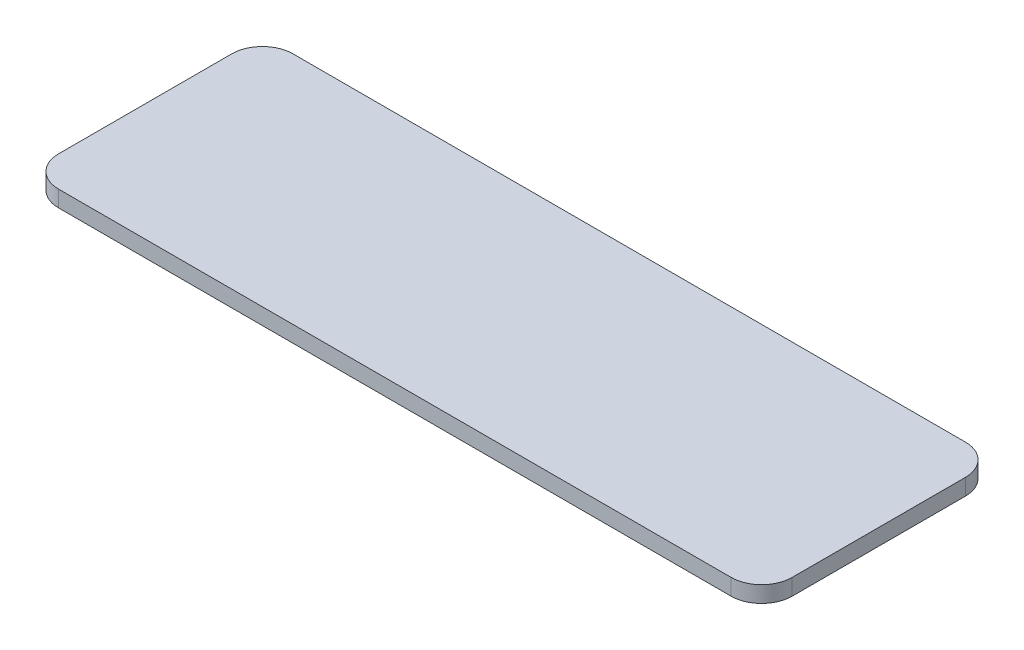
ISO-10303-21;
HEADER;
FILE_DESCRIPTION(('STEP AP214'),'2;1');
FILE_NAME('part.step','',(''),(''),'','','');
FILE_SCHEMA(('AUTOMOTIVE_DESIGN { 1 0 10303 214 1 1 1 1 }'));
ENDSEC;
DATA;
#1=APPLICATION_CONTEXT('core data for automotive mechanical design processes');
#2=APPLICATION_PROTOCOL_DEFINITION('international standard','automotive_design',2000,#1);
#3=PRODUCT_CONTEXT('',#1,'mechanical');
#4=PRODUCT('Part','Part','',(#3));
#5=PRODUCT_RELATED_PRODUCT_CATEGORY('part','',(#4));
#6=PRODUCT_DEFINITION_FORMATION('','',#4);
#7=PRODUCT_DEFINITION_CONTEXT('part definition',#1,'design');
#8=PRODUCT_DEFINITION('design','',#6,#7);
#9=PRODUCT_DEFINITION_SHAPE('','',#8);
#10=(LENGTH_UNIT() NAMED_UNIT(*) SI_UNIT(.MILLI.,.METRE.));
#11=(NAMED_UNIT(*) PLANE_ANGLE_UNIT() SI_UNIT($,.RADIAN.));
#12=(NAMED_UNIT(*) SI_UNIT($,.STERADIAN.) SOLID_ANGLE_UNIT());
#13=UNCERTAINTY_MEASURE_WITH_UNIT(LENGTH_MEASURE(1.E-05),#10,'distance_accuracy_value','');
#14=(GEOMETRIC_REPRESENTATION_CONTEXT(3) GLOBAL_UNCERTAINTY_ASSIGNED_CONTEXT((#13)) GLOBAL_UNIT_ASSIGNED_CONTEXT((#10,
#11,#12)) REPRESENTATION_CONTEXT('',''));
#15=CARTESIAN_POINT('',(0.,0.,0.));
#16=DIRECTION('',(0.,0.,1.));
#17=DIRECTION('',(1.,0.,0.));
#18=AXIS2_PLACEMENT_3D('',#15,#16,#17);
#19=CARTESIAN_POINT('',(3.,1.6,-3.));
#20=DIRECTION('',(0.,-1.,0.));
#21=DIRECTION('',(0.,0.,-1.));
#22=AXIS2_PLACEMENT_3D('',#19,#20,#21);
#23=CYLINDRICAL_SURFACE('',#22,3.);
#24=CARTESIAN_POINT('',(3.,0.,-3.));
#25=DIRECTION('',(0.,1.,0.));
#26=DIRECTION('',(0.,0.,-1.));
#27=AXIS2_PLACEMENT_3D('',#24,#25,#26);
#28=CIRCLE('',#27,3.);
#29=CARTESIAN_POINT('',(0.,0.,-3.00000000000002));
#30=VERTEX_POINT('',#29);
#31=CARTESIAN_POINT('',(3.00000000000002,0.,0.));
#32=VERTEX_POINT('',#31);
#33=EDGE_CURVE('E128',#30,#32,#28,.T.);
#34=ORIENTED_EDGE('',*,*,#33,.T.);
#35=DIRECTION('',(0.,-1.,0.));
#36=VECTOR('',#35,1.);
#37=CARTESIAN_POINT('',(3.00000000000002,1.6,0.));
#38=LINE('',#37,#36);
#39=CARTESIAN_POINT('',(3.00000000000002,1.6,0.));
#40=VERTEX_POINT('',#39);
#41=EDGE_CURVE('E11',#40,#32,#38,.T.);
#42=ORIENTED_EDGE('',*,*,#41,.F.);
#43=CARTESIAN_POINT('',(3.,1.6,-3.));
#44=DIRECTION('',(0.,1.,0.));
#45=DIRECTION('',(0.,0.,-1.));
#46=AXIS2_PLACEMENT_3D('',#43,#44,#45);
#47=CIRCLE('',#46,3.);
#48=CARTESIAN_POINT('',(0.,1.6,-3.00000000000002));
#49=VERTEX_POINT('',#48);
#50=EDGE_CURVE('E142',#49,#40,#47,.T.);
#51=ORIENTED_EDGE('',*,*,#50,.F.);
#52=DIRECTION('',(0.,-1.,0.));
#53=VECTOR('',#52,1.);
#54=CARTESIAN_POINT('',(0.,1.6,-3.00000000000002));
#55=LINE('',#54,#53);
#56=EDGE_CURVE('E124',#49,#30,#55,.T.);
#57=ORIENTED_EDGE('',*,*,#56,.T.);
#58=EDGE_LOOP('',(#34,#42,#51,#57));
#59=FACE_BOUND('',#58,.T.);
#60=ADVANCED_FACE('F32',(#59),#23,.T.);
#61=CARTESIAN_POINT('',(3.00000000000002,1.6,0.));
#62=DIRECTION('',(0.,0.,-1.));
#63=DIRECTION('',(-1.,0.,0.));
#64=AXIS2_PLACEMENT_3D('',#61,#62,#63);
#65=PLANE('',#64);
#66=DIRECTION('',(1.,0.,0.));
#67=VECTOR('',#66,1.);
#68=CARTESIAN_POINT('',(3.00000000000002,0.,0.));
#69=LINE('',#68,#67);
#70=CARTESIAN_POINT('',(69.,0.,0.));
#71=VERTEX_POINT('',#70);
#72=EDGE_CURVE('E131',#32,#71,#69,.T.);
#73=ORIENTED_EDGE('',*,*,#72,.T.);
#74=DIRECTION('',(0.,-1.,0.));
#75=VECTOR('',#74,1.);
#76=CARTESIAN_POINT('',(69.,1.6,0.));
#77=LINE('',#76,#75);
#78=CARTESIAN_POINT('',(69.,1.6,0.));
#79=VERTEX_POINT('',#78);
#80=EDGE_CURVE('E40',#79,#71,#77,.T.);
#81=ORIENTED_EDGE('',*,*,#80,.F.);
#82=DIRECTION('',(1.,0.,0.));
#83=VECTOR('',#82,1.);
#84=CARTESIAN_POINT('',(3.00000000000002,1.6,0.));
#85=LINE('',#84,#83);
#86=EDGE_CURVE('E91',#40,#79,#85,.T.);
#87=ORIENTED_EDGE('',*,*,#86,.F.);
#88=ORIENTED_EDGE('',*,*,#41,.T.);
#89=EDGE_LOOP('',(#73,#81,#87,#88));
#90=FACE_BOUND('',#89,.T.);
#91=ADVANCED_FACE('F177',(#90),#65,.F.);
#92=CARTESIAN_POINT('',(69.,1.6,-3.));
#93=DIRECTION('',(0.,-1.,0.));
#94=DIRECTION('',(0.,0.,-1.));
#95=AXIS2_PLACEMENT_3D('',#92,#93,#94);
#96=CYLINDRICAL_SURFACE('',#95,3.);
#97=CARTESIAN_POINT('',(69.,0.,-3.));
#98=DIRECTION('',(0.,1.,0.));
#99=DIRECTION('',(0.,0.,1.));
#100=AXIS2_PLACEMENT_3D('',#97,#98,#99);
#101=CIRCLE('',#100,3.);
#102=CARTESIAN_POINT('',(72.,0.,-3.00000000000002));
#103=VERTEX_POINT('',#102);
#104=EDGE_CURVE('E133',#71,#103,#101,.T.);
#105=ORIENTED_EDGE('',*,*,#104,.T.);
#106=DIRECTION('',(0.,-1.,0.));
#107=VECTOR('',#106,1.);
#108=CARTESIAN_POINT('',(72.,1.6,-3.00000000000002));
#109=LINE('',#108,#107);
#110=CARTESIAN_POINT('',(72.,1.6,-3.00000000000002));
#111=VERTEX_POINT('',#110);
#112=EDGE_CURVE('E149',#111,#103,#109,.T.);
#113=ORIENTED_EDGE('',*,*,#112,.F.);
#114=CARTESIAN_POINT('',(69.,1.6,-3.));
#115=DIRECTION('',(0.,1.,0.));
#116=DIRECTION('',(0.,0.,1.));
#117=AXIS2_PLACEMENT_3D('',#114,#115,#116);
#118=CIRCLE('',#117,3.);
#119=EDGE_CURVE('E157',#79,#111,#118,.T.);
#120=ORIENTED_EDGE('',*,*,#119,.F.);
#121=ORIENTED_EDGE('',*,*,#80,.T.);
#122=EDGE_LOOP('',(#105,#113,#120,#121));
#123=FACE_BOUND('',#122,.T.);
#124=ADVANCED_FACE('F155',(#123),#96,.T.);
#125=CARTESIAN_POINT('',(72.,1.6,-3.00000000000002));
#126=DIRECTION('',(-1.,0.,0.));
#127=DIRECTION('',(0.,0.,1.));
#128=AXIS2_PLACEMENT_3D('',#125,#126,#127);
#129=PLANE('',#128);
#130=DIRECTION('',(0.,0.,-1.));
#131=VECTOR('',#130,1.);
#132=CARTESIAN_POINT('',(72.,0.,-3.00000000000002));
#133=LINE('',#132,#131);
#134=CARTESIAN_POINT('',(72.,0.,-20.));
#135=VERTEX_POINT('',#134);
#136=EDGE_CURVE('E135',#103,#135,#133,.T.);
#137=ORIENTED_EDGE('',*,*,#136,.T.);
#138=DIRECTION('',(0.,-1.,0.));
#139=VECTOR('',#138,1.);
#140=CARTESIAN_POINT('',(72.,1.6,-20.));
#141=LINE('',#140,#139);
#142=CARTESIAN_POINT('',(72.,1.6,-20.));
#143=VERTEX_POINT('',#142);
#144=EDGE_CURVE('E146',#143,#135,#141,.T.);
#145=ORIENTED_EDGE('',*,*,#144,.F.);
#146=DIRECTION('',(0.,0.,-1.));
#147=VECTOR('',#146,1.);
#148=CARTESIAN_POINT('',(72.,1.6,-3.00000000000002));
#149=LINE('',#148,#147);
#150=EDGE_CURVE('E169',#111,#143,#149,.T.);
#151=ORIENTED_EDGE('',*,*,#150,.F.);
#152=ORIENTED_EDGE('',*,*,#112,.T.);
#153=EDGE_LOOP('',(#137,#145,#151,#152));
#154=FACE_BOUND('',#153,.T.);
#155=ADVANCED_FACE('F165',(#154),#129,.F.);
#156=CARTESIAN_POINT('',(69.,1.6,-20.));
#157=DIRECTION('',(0.,-1.,0.));
#158=DIRECTION('',(0.,0.,-1.));
#159=AXIS2_PLACEMENT_3D('',#156,#157,#158);
#160=CYLINDRICAL_SURFACE('',#159,3.);
#161=CARTESIAN_POINT('',(69.,0.,-20.));
#162=DIRECTION('',(0.,1.,0.));
#163=DIRECTION('',(0.,0.,-1.));
#164=AXIS2_PLACEMENT_3D('',#161,#162,#163);
#165=CIRCLE('',#164,3.);
#166=CARTESIAN_POINT('',(69.,0.,-23.));
#167=VERTEX_POINT('',#166);
#168=EDGE_CURVE('E137',#135,#167,#165,.T.);
#169=ORIENTED_EDGE('',*,*,#168,.T.);
#170=DIRECTION('',(0.,-1.,0.));
#171=VECTOR('',#170,1.);
#172=CARTESIAN_POINT('',(69.,1.6,-23.));
#173=LINE('',#172,#171);
#174=CARTESIAN_POINT('',(69.,1.6,-23.));
#175=VERTEX_POINT('',#174);
#176=EDGE_CURVE('E119',#175,#167,#173,.T.);
#177=ORIENTED_EDGE('',*,*,#176,.F.);
#178=CARTESIAN_POINT('',(69.,1.6,-20.));
#179=DIRECTION('',(0.,1.,0.));
#180=DIRECTION('',(0.,0.,-1.));
#181=AXIS2_PLACEMENT_3D('',#178,#179,#180);
#182=CIRCLE('',#181,3.);
#183=EDGE_CURVE('E110',#143,#175,#182,.T.);
#184=ORIENTED_EDGE('',*,*,#183,.F.);
#185=ORIENTED_EDGE('',*,*,#144,.T.);
#186=EDGE_LOOP('',(#169,#177,#184,#185));
#187=FACE_BOUND('',#186,.T.);
#188=ADVANCED_FACE('F168',(#187),#160,.T.);
#189=CARTESIAN_POINT('',(3.00000000000002,1.6,-23.));
#190=DIRECTION('',(0.,0.,1.));
#191=DIRECTION('',(1.,0.,0.));
#192=AXIS2_PLACEMENT_3D('',#189,#190,#191);
#193=PLANE('',#192);
#194=DIRECTION('',(-1.,0.,0.));
#195=VECTOR('',#194,1.);
#196=CARTESIAN_POINT('',(3.00000000000002,0.,-23.));
#197=LINE('',#196,#195);
#198=CARTESIAN_POINT('',(3.00000000000002,0.,-23.));
#199=VERTEX_POINT('',#198);
#200=EDGE_CURVE('E118',#167,#199,#197,.T.);
#201=ORIENTED_EDGE('',*,*,#200,.T.);
#202=DIRECTION('',(0.,-1.,0.));
#203=VECTOR('',#202,1.);
#204=CARTESIAN_POINT('',(3.00000000000002,1.6,-23.));
#205=LINE('',#204,#203);
#206=CARTESIAN_POINT('',(3.00000000000002,1.6,-23.));
#207=VERTEX_POINT('',#206);
#208=EDGE_CURVE('E115',#207,#199,#205,.T.);
#209=ORIENTED_EDGE('',*,*,#208,.F.);
#210=DIRECTION('',(-1.,0.,0.));
#211=VECTOR('',#210,1.);
#212=CARTESIAN_POINT('',(3.00000000000002,1.6,-23.));
#213=LINE('',#212,#211);
#214=EDGE_CURVE('E104',#175,#207,#213,.T.);
#215=ORIENTED_EDGE('',*,*,#214,.F.);
#216=ORIENTED_EDGE('',*,*,#176,.T.);
#217=EDGE_LOOP('',(#201,#209,#215,#216));
#218=FACE_BOUND('',#217,.T.);
#219=ADVANCED_FACE('F116',(#218),#193,.F.);
#220=CARTESIAN_POINT('',(3.,1.6,-20.));
#221=DIRECTION('',(0.,-1.,0.));
#222=DIRECTION('',(0.,0.,-1.));
#223=AXIS2_PLACEMENT_3D('',#220,#221,#222);
#224=CYLINDRICAL_SURFACE('',#223,3.);
#225=CARTESIAN_POINT('',(3.,0.,-20.));
#226=DIRECTION('',(0.,1.,0.));
#227=DIRECTION('',(0.,0.,-1.));
#228=AXIS2_PLACEMENT_3D('',#225,#226,#227);
#229=CIRCLE('',#228,3.);
#230=CARTESIAN_POINT('',(0.,0.,-20.));
#231=VERTEX_POINT('',#230);
#232=EDGE_CURVE('E77',#199,#231,#229,.T.);
#233=ORIENTED_EDGE('',*,*,#232,.T.);
#234=DIRECTION('',(0.,-1.,0.));
#235=VECTOR('',#234,1.);
#236=CARTESIAN_POINT('',(0.,1.6,-20.));
#237=LINE('',#236,#235);
#238=CARTESIAN_POINT('',(0.,1.6,-20.));
#239=VERTEX_POINT('',#238);
#240=EDGE_CURVE('E120',#239,#231,#237,.T.);
#241=ORIENTED_EDGE('',*,*,#240,.F.);
#242=CARTESIAN_POINT('',(3.,1.6,-20.));
#243=DIRECTION('',(0.,1.,0.));
#244=DIRECTION('',(0.,0.,-1.));
#245=AXIS2_PLACEMENT_3D('',#242,#243,#244);
#246=CIRCLE('',#245,3.);
#247=EDGE_CURVE('E108',#207,#239,#246,.T.);
#248=ORIENTED_EDGE('',*,*,#247,.F.);
#249=ORIENTED_EDGE('',*,*,#208,.T.);
#250=EDGE_LOOP('',(#233,#241,#248,#249));
#251=FACE_BOUND('',#250,.T.);
#252=ADVANCED_FACE('F122',(#251),#224,.T.);
#253=CARTESIAN_POINT('',(0.,1.6,-3.00000000000002));
#254=DIRECTION('',(1.,0.,0.));
#255=DIRECTION('',(0.,0.,-1.));
#256=AXIS2_PLACEMENT_3D('',#253,#254,#255);
#257=PLANE('',#256);
#258=DIRECTION('',(0.,0.,1.));
#259=VECTOR('',#258,1.);
#260=CARTESIAN_POINT('',(0.,0.,-3.00000000000002));
#261=LINE('',#260,#259);
#262=EDGE_CURVE('E83',#231,#30,#261,.T.);
#263=ORIENTED_EDGE('',*,*,#262,.T.);
#264=ORIENTED_EDGE('',*,*,#56,.F.);
#265=DIRECTION('',(0.,0.,1.));
#266=VECTOR('',#265,1.);
#267=CARTESIAN_POINT('',(0.,1.6,-3.00000000000002));
#268=LINE('',#267,#266);
#269=EDGE_CURVE('E48',#239,#49,#268,.T.);
#270=ORIENTED_EDGE('',*,*,#269,.F.);
#271=ORIENTED_EDGE('',*,*,#240,.T.);
#272=EDGE_LOOP('',(#263,#264,#270,#271));
#273=FACE_BOUND('',#272,.T.);
#274=ADVANCED_FACE('F193',(#273),#257,.F.);
#275=CARTESIAN_POINT('',(3.,1.6,-3.));
#276=DIRECTION('',(0.,-1.,0.));
#277=DIRECTION('',(0.,0.,-1.));
#278=AXIS2_PLACEMENT_3D('',#275,#276,#277);
#279=PLANE('',#278);
#280=ORIENTED_EDGE('',*,*,#50,.T.);
#281=ORIENTED_EDGE('',*,*,#86,.T.);
#282=ORIENTED_EDGE('',*,*,#119,.T.);
#283=ORIENTED_EDGE('',*,*,#150,.T.);
#284=ORIENTED_EDGE('',*,*,#183,.T.);
#285=ORIENTED_EDGE('',*,*,#214,.T.);
#286=ORIENTED_EDGE('',*,*,#247,.T.);
#287=ORIENTED_EDGE('',*,*,#269,.T.);
#288=EDGE_LOOP('',(#280,#281,#282,#283,#284,#285,#286,#287));
#289=FACE_BOUND('',#288,.T.);
#290=ADVANCED_FACE('F106',(#289),#279,.F.);
#291=CARTESIAN_POINT('',(3.,0.,-3.));
#292=DIRECTION('',(0.,-1.,0.));
#293=DIRECTION('',(0.,0.,-1.));
#294=AXIS2_PLACEMENT_3D('',#291,#292,#293);
#295=PLANE('',#294);
#296=ORIENTED_EDGE('',*,*,#33,.F.);
#297=ORIENTED_EDGE('',*,*,#262,.F.);
#298=ORIENTED_EDGE('',*,*,#232,.F.);
#299=ORIENTED_EDGE('',*,*,#200,.F.);
#300=ORIENTED_EDGE('',*,*,#168,.F.);
#301=ORIENTED_EDGE('',*,*,#136,.F.);
#302=ORIENTED_EDGE('',*,*,#104,.F.);
#303=ORIENTED_EDGE('',*,*,#72,.F.);
#304=EDGE_LOOP('',(#296,#297,#298,#299,#300,#301,#302,#303));
#305=FACE_BOUND('',#304,.T.);
#306=ADVANCED_FACE('F161',(#305),#295,.T.);
#307=CLOSED_SHELL('',(#60,#91,#124,#155,#188,#219,#252,#274,#290,#306));
#308=MANIFOLD_SOLID_BREP('B2',#307);
#309=ADVANCED_BREP_SHAPE_REPRESENTATION('',(#18,#308),#14);
#310=SHAPE_DEFINITION_REPRESENTATION(#9,#309);
ENDSEC;
END-ISO-10303-21;
